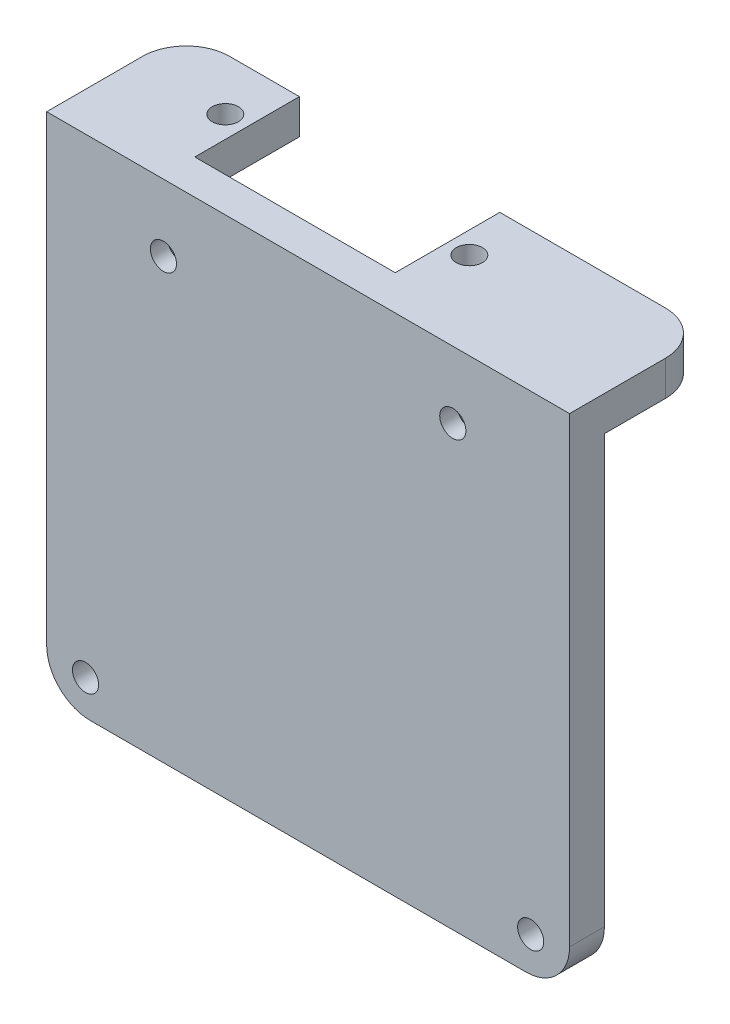
ISO-10303-21;
HEADER;
FILE_DESCRIPTION(('STEP AP214'),'2;1');
FILE_NAME('part.step','',(''),(''),'','','');
FILE_SCHEMA(('AUTOMOTIVE_DESIGN { 1 0 10303 214 1 1 1 1 }'));
ENDSEC;
DATA;
#1=APPLICATION_CONTEXT('core data for automotive mechanical design processes');
#2=APPLICATION_PROTOCOL_DEFINITION('international standard','automotive_design',2000,#1);
#3=PRODUCT_CONTEXT('',#1,'mechanical');
#4=PRODUCT('Part','Part','',(#3));
#5=PRODUCT_RELATED_PRODUCT_CATEGORY('part','',(#4));
#6=PRODUCT_DEFINITION_FORMATION('','',#4);
#7=PRODUCT_DEFINITION_CONTEXT('part definition',#1,'design');
#8=PRODUCT_DEFINITION('design','',#6,#7);
#9=PRODUCT_DEFINITION_SHAPE('','',#8);
#10=(LENGTH_UNIT() NAMED_UNIT(*) SI_UNIT(.MILLI.,.METRE.));
#11=(NAMED_UNIT(*) PLANE_ANGLE_UNIT() SI_UNIT($,.RADIAN.));
#12=(NAMED_UNIT(*) SI_UNIT($,.STERADIAN.) SOLID_ANGLE_UNIT());
#13=UNCERTAINTY_MEASURE_WITH_UNIT(LENGTH_MEASURE(1.E-05),#10,'distance_accuracy_value','');
#14=(GEOMETRIC_REPRESENTATION_CONTEXT(3) GLOBAL_UNCERTAINTY_ASSIGNED_CONTEXT((#13)) GLOBAL_UNIT_ASSIGNED_CONTEXT((#10,
#11,#12)) REPRESENTATION_CONTEXT('',''));
#15=CARTESIAN_POINT('',(0.,0.,0.));
#16=DIRECTION('',(0.,0.,1.));
#17=DIRECTION('',(1.,0.,0.));
#18=AXIS2_PLACEMENT_3D('',#15,#16,#17);
#19=CARTESIAN_POINT('',(55.,-53.,0.));
#20=DIRECTION('',(0.,0.,1.));
#21=DIRECTION('',(1.,0.,0.));
#22=AXIS2_PLACEMENT_3D('',#19,#20,#21);
#23=PLANE('',#22);
#24=CARTESIAN_POINT('',(55.540235122517,-53.9862116102653,0.));
#25=DIRECTION('',(0.,0.,1.));
#26=DIRECTION('',(-1.,0.,0.));
#27=AXIS2_PLACEMENT_3D('',#24,#25,#26);
#28=CIRCLE('',#27,1.5);
#29=CARTESIAN_POINT('',(54.040235122517,-53.9862116102653,0.));
#30=VERTEX_POINT('',#29);
#31=EDGE_CURVE('E297',#30,#30,#28,.T.);
#32=ORIENTED_EDGE('',*,*,#31,.T.);
#33=EDGE_LOOP('',(#32));
#34=FACE_BOUND('',#33,.T.);
#35=CARTESIAN_POINT('',(4.45976487748301,-53.9862116102653,0.));
#36=DIRECTION('',(0.,0.,1.));
#37=DIRECTION('',(1.,0.,0.));
#38=AXIS2_PLACEMENT_3D('',#35,#36,#37);
#39=CIRCLE('',#38,1.5);
#40=CARTESIAN_POINT('',(5.95976487748301,-53.9862116102653,0.));
#41=VERTEX_POINT('',#40);
#42=EDGE_CURVE('E291',#41,#41,#39,.T.);
#43=ORIENTED_EDGE('',*,*,#42,.T.);
#44=EDGE_LOOP('',(#43));
#45=FACE_BOUND('',#44,.T.);
#46=CARTESIAN_POINT('',(13.3970401574915,-7.66880337009083,0.));
#47=DIRECTION('',(0.,0.,1.));
#48=DIRECTION('',(1.,0.,0.));
#49=AXIS2_PLACEMENT_3D('',#46,#47,#48);
#50=CIRCLE('',#49,3.5);
#51=CARTESIAN_POINT('',(16.8970401574915,-7.66880337009083,0.));
#52=VERTEX_POINT('',#51);
#53=EDGE_CURVE('E349',#52,#52,#50,.T.);
#54=ORIENTED_EDGE('',*,*,#53,.T.);
#55=EDGE_LOOP('',(#54));
#56=FACE_BOUND('',#55,.T.);
#57=CARTESIAN_POINT('',(46.6029598425085,-7.66880337009083,0.));
#58=DIRECTION('',(0.,0.,1.));
#59=DIRECTION('',(1.,0.,0.));
#60=AXIS2_PLACEMENT_3D('',#57,#58,#59);
#61=CIRCLE('',#60,3.5);
#62=CARTESIAN_POINT('',(50.1029598425085,-7.66880337009083,0.));
#63=VERTEX_POINT('',#62);
#64=EDGE_CURVE('E352',#63,#63,#61,.T.);
#65=ORIENTED_EDGE('',*,*,#64,.T.);
#66=EDGE_LOOP('',(#65));
#67=FACE_BOUND('',#66,.T.);
#68=DIRECTION('',(0.,-1.,0.));
#69=VECTOR('',#68,1.);
#70=CARTESIAN_POINT('',(39.4977449043397,-53.,0.));
#71=LINE('',#70,#69);
#72=CARTESIAN_POINT('',(39.4977449043397,-53.,0.));
#73=VERTEX_POINT('',#72);
#74=CARTESIAN_POINT('',(39.4977449043397,-58.,0.));
#75=VERTEX_POINT('',#74);
#76=EDGE_CURVE('E181',#73,#75,#71,.T.);
#77=ORIENTED_EDGE('',*,*,#76,.F.);
#78=DIRECTION('',(1.,0.,0.));
#79=VECTOR('',#78,1.);
#80=CARTESIAN_POINT('',(19.4977449043397,-53.,0.));
#81=LINE('',#80,#79);
#82=CARTESIAN_POINT('',(19.4977449043397,-53.,0.));
#83=VERTEX_POINT('',#82);
#84=EDGE_CURVE('E190',#83,#73,#81,.T.);
#85=ORIENTED_EDGE('',*,*,#84,.F.);
#86=DIRECTION('',(0.,1.,0.));
#87=VECTOR('',#86,1.);
#88=CARTESIAN_POINT('',(19.4977449043397,-58.,0.));
#89=LINE('',#88,#87);
#90=CARTESIAN_POINT('',(19.4977449043397,-58.,0.));
#91=VERTEX_POINT('',#90);
#92=EDGE_CURVE('E200',#91,#83,#89,.T.);
#93=ORIENTED_EDGE('',*,*,#92,.F.);
#94=DIRECTION('',(1.,0.,0.));
#95=VECTOR('',#94,1.);
#96=CARTESIAN_POINT('',(5.00000000000001,-58.,0.));
#97=LINE('',#96,#95);
#98=CARTESIAN_POINT('',(5.00000000000001,-58.,0.));
#99=VERTEX_POINT('',#98);
#100=EDGE_CURVE('E309',#99,#91,#97,.T.);
#101=ORIENTED_EDGE('',*,*,#100,.F.);
#102=CARTESIAN_POINT('',(5.00000000000001,-53.,0.));
#103=DIRECTION('',(0.,0.,1.));
#104=DIRECTION('',(-1.,0.,0.));
#105=AXIS2_PLACEMENT_3D('',#102,#103,#104);
#106=CIRCLE('',#105,5.);
#107=CARTESIAN_POINT('',(0.,-53.,0.));
#108=VERTEX_POINT('',#107);
#109=EDGE_CURVE('E330',#108,#99,#106,.T.);
#110=ORIENTED_EDGE('',*,*,#109,.F.);
#111=DIRECTION('',(0.,-1.,0.));
#112=VECTOR('',#111,1.);
#113=CARTESIAN_POINT('',(0.,0.,0.));
#114=LINE('',#113,#112);
#115=CARTESIAN_POINT('',(0.,-4.,0.));
#116=VERTEX_POINT('',#115);
#117=EDGE_CURVE('E328',#116,#108,#114,.T.);
#118=ORIENTED_EDGE('',*,*,#117,.F.);
#119=DIRECTION('',(-1.,0.,0.));
#120=VECTOR('',#119,1.);
#121=CARTESIAN_POINT('',(8.00000000000001,-4.,0.));
#122=LINE('',#121,#120);
#123=CARTESIAN_POINT('',(13.,-4.,0.));
#124=VERTEX_POINT('',#123);
#125=EDGE_CURVE('E258',#124,#116,#122,.T.);
#126=ORIENTED_EDGE('',*,*,#125,.F.);
#127=DIRECTION('',(0.,-1.,0.));
#128=VECTOR('',#127,1.);
#129=CARTESIAN_POINT('',(13.,0.,0.));
#130=LINE('',#129,#128);
#131=CARTESIAN_POINT('',(13.,0.,0.));
#132=VERTEX_POINT('',#131);
#133=EDGE_CURVE('E260',#132,#124,#130,.T.);
#134=ORIENTED_EDGE('',*,*,#133,.F.);
#135=DIRECTION('',(-1.,0.,0.));
#136=VECTOR('',#135,1.);
#137=CARTESIAN_POINT('',(0.,0.,0.));
#138=LINE('',#137,#136);
#139=CARTESIAN_POINT('',(36.,0.,0.));
#140=VERTEX_POINT('',#139);
#141=EDGE_CURVE('E325',#140,#132,#138,.T.);
#142=ORIENTED_EDGE('',*,*,#141,.F.);
#143=DIRECTION('',(0.,1.,0.));
#144=VECTOR('',#143,1.);
#145=CARTESIAN_POINT('',(36.,0.,0.));
#146=LINE('',#145,#144);
#147=CARTESIAN_POINT('',(36.,-4.,0.));
#148=VERTEX_POINT('',#147);
#149=EDGE_CURVE('E272',#148,#140,#146,.T.);
#150=ORIENTED_EDGE('',*,*,#149,.F.);
#151=DIRECTION('',(-1.,0.,0.));
#152=VECTOR('',#151,1.);
#153=CARTESIAN_POINT('',(41.,-4.,0.));
#154=LINE('',#153,#152);
#155=CARTESIAN_POINT('',(60.,-3.99999999999998,0.));
#156=VERTEX_POINT('',#155);
#157=EDGE_CURVE('E263',#156,#148,#154,.T.);
#158=ORIENTED_EDGE('',*,*,#157,.F.);
#159=DIRECTION('',(0.,1.,0.));
#160=VECTOR('',#159,1.);
#161=CARTESIAN_POINT('',(60.,0.,0.));
#162=LINE('',#161,#160);
#163=CARTESIAN_POINT('',(60.,-53.,0.));
#164=VERTEX_POINT('',#163);
#165=EDGE_CURVE('E322',#164,#156,#162,.T.);
#166=ORIENTED_EDGE('',*,*,#165,.F.);
#167=CARTESIAN_POINT('',(55.,-53.,0.));
#168=DIRECTION('',(0.,0.,1.));
#169=DIRECTION('',(1.,0.,0.));
#170=AXIS2_PLACEMENT_3D('',#167,#168,#169);
#171=CIRCLE('',#170,5.);
#172=CARTESIAN_POINT('',(55.,-58.,0.));
#173=VERTEX_POINT('',#172);
#174=EDGE_CURVE('E304',#173,#164,#171,.T.);
#175=ORIENTED_EDGE('',*,*,#174,.F.);
#176=EDGE_CURVE('E199',#75,#173,#97,.T.);
#177=ORIENTED_EDGE('',*,*,#176,.F.);
#178=EDGE_LOOP('',(#77,#85,#93,#101,#110,#118,#126,#134,#142,#150,#158,#166,#175,#177));
#179=FACE_BOUND('',#178,.T.);
#180=ADVANCED_FACE('F39',(#34,#45,#56,#67,#179),#23,.F.);
#181=CARTESIAN_POINT('',(55.,-53.,4.));
#182=DIRECTION('',(0.,0.,-1.));
#183=DIRECTION('',(-1.,0.,0.));
#184=AXIS2_PLACEMENT_3D('',#181,#182,#183);
#185=CYLINDRICAL_SURFACE('',#184,5.);
#186=ORIENTED_EDGE('',*,*,#174,.T.);
#187=DIRECTION('',(0.,0.,-1.));
#188=VECTOR('',#187,1.);
#189=CARTESIAN_POINT('',(60.,-53.,4.));
#190=LINE('',#189,#188);
#191=CARTESIAN_POINT('',(60.,-53.,4.));
#192=VERTEX_POINT('',#191);
#193=EDGE_CURVE('E346',#192,#164,#190,.T.);
#194=ORIENTED_EDGE('',*,*,#193,.F.);
#195=CARTESIAN_POINT('',(55.,-53.,4.));
#196=DIRECTION('',(0.,0.,1.));
#197=DIRECTION('',(1.,0.,0.));
#198=AXIS2_PLACEMENT_3D('',#195,#196,#197);
#199=CIRCLE('',#198,5.);
#200=CARTESIAN_POINT('',(55.,-58.,4.));
#201=VERTEX_POINT('',#200);
#202=EDGE_CURVE('E305',#201,#192,#199,.T.);
#203=ORIENTED_EDGE('',*,*,#202,.F.);
#204=DIRECTION('',(0.,0.,-1.));
#205=VECTOR('',#204,1.);
#206=CARTESIAN_POINT('',(55.,-58.,4.));
#207=LINE('',#206,#205);
#208=EDGE_CURVE('E319',#201,#173,#207,.T.);
#209=ORIENTED_EDGE('',*,*,#208,.T.);
#210=EDGE_LOOP('',(#186,#194,#203,#209));
#211=FACE_BOUND('',#210,.T.);
#212=ADVANCED_FACE('F430',(#211),#185,.T.);
#213=CARTESIAN_POINT('',(60.,0.,4.));
#214=DIRECTION('',(-1.,0.,0.));
#215=DIRECTION('',(0.,-1.,0.));
#216=AXIS2_PLACEMENT_3D('',#213,#214,#215);
#217=PLANE('',#216);
#218=ORIENTED_EDGE('',*,*,#165,.T.);
#219=DIRECTION('',(0.,0.,-1.));
#220=VECTOR('',#219,1.);
#221=CARTESIAN_POINT('',(60.,-3.99999999999998,0.));
#222=LINE('',#221,#220);
#223=CARTESIAN_POINT('',(60.,-3.99999999999998,-7.));
#224=VERTEX_POINT('',#223);
#225=EDGE_CURVE('E241',#156,#224,#222,.T.);
#226=ORIENTED_EDGE('',*,*,#225,.T.);
#227=DIRECTION('',(0.,1.,0.));
#228=VECTOR('',#227,1.);
#229=CARTESIAN_POINT('',(60.,-3.99999999999998,-7.));
#230=LINE('',#229,#228);
#231=CARTESIAN_POINT('',(60.,0.,-7.));
#232=VERTEX_POINT('',#231);
#233=EDGE_CURVE('E247',#224,#232,#230,.T.);
#234=ORIENTED_EDGE('',*,*,#233,.T.);
#235=DIRECTION('',(0.,0.,-1.));
#236=VECTOR('',#235,1.);
#237=CARTESIAN_POINT('',(60.,0.,4.));
#238=LINE('',#237,#236);
#239=CARTESIAN_POINT('',(60.,0.,4.));
#240=VERTEX_POINT('',#239);
#241=EDGE_CURVE('E344',#240,#232,#238,.T.);
#242=ORIENTED_EDGE('',*,*,#241,.F.);
#243=DIRECTION('',(0.,1.,0.));
#244=VECTOR('',#243,1.);
#245=CARTESIAN_POINT('',(60.,0.,4.));
#246=LINE('',#245,#244);
#247=EDGE_CURVE('E308',#192,#240,#246,.T.);
#248=ORIENTED_EDGE('',*,*,#247,.F.);
#249=ORIENTED_EDGE('',*,*,#193,.T.);
#250=EDGE_LOOP('',(#218,#226,#234,#242,#248,#249));
#251=FACE_BOUND('',#250,.T.);
#252=ADVANCED_FACE('F427',(#251),#217,.F.);
#253=CARTESIAN_POINT('',(0.,0.,4.));
#254=DIRECTION('',(0.,-1.,0.));
#255=DIRECTION('',(1.,0.,0.));
#256=AXIS2_PLACEMENT_3D('',#253,#254,#255);
#257=PLANE('',#256);
#258=CARTESIAN_POINT('',(10.5,0.,-6.));
#259=DIRECTION('',(0.,1.,0.));
#260=DIRECTION('',(-1.,0.,0.));
#261=AXIS2_PLACEMENT_3D('',#258,#259,#260);
#262=CIRCLE('',#261,1.5);
#263=CARTESIAN_POINT('',(9.00000000000001,0.,-6.));
#264=VERTEX_POINT('',#263);
#265=EDGE_CURVE('E215',#264,#264,#262,.T.);
#266=ORIENTED_EDGE('',*,*,#265,.F.);
#267=EDGE_LOOP('',(#266));
#268=FACE_BOUND('',#267,.T.);
#269=CARTESIAN_POINT('',(38.5,0.,-6.));
#270=DIRECTION('',(0.,1.,0.));
#271=DIRECTION('',(1.,0.,0.));
#272=AXIS2_PLACEMENT_3D('',#269,#270,#271);
#273=CIRCLE('',#272,1.5);
#274=CARTESIAN_POINT('',(40.,0.,-6.));
#275=VERTEX_POINT('',#274);
#276=EDGE_CURVE('E218',#275,#275,#273,.T.);
#277=ORIENTED_EDGE('',*,*,#276,.F.);
#278=EDGE_LOOP('',(#277));
#279=FACE_BOUND('',#278,.T.);
#280=CARTESIAN_POINT('',(5.,0.,-7.));
#281=DIRECTION('',(0.,1.,0.));
#282=DIRECTION('',(1.,0.,0.));
#283=AXIS2_PLACEMENT_3D('',#280,#281,#282);
#284=CIRCLE('',#283,5.);
#285=CARTESIAN_POINT('',(5.,0.,-12.));
#286=VERTEX_POINT('',#285);
#287=CARTESIAN_POINT('',(0.,0.,-7.));
#288=VERTEX_POINT('',#287);
#289=EDGE_CURVE('E229',#286,#288,#284,.T.);
#290=ORIENTED_EDGE('',*,*,#289,.T.);
#291=DIRECTION('',(0.,0.,-1.));
#292=VECTOR('',#291,1.);
#293=CARTESIAN_POINT('',(0.,0.,4.));
#294=LINE('',#293,#292);
#295=CARTESIAN_POINT('',(0.,0.,4.));
#296=VERTEX_POINT('',#295);
#297=EDGE_CURVE('E342',#296,#288,#294,.T.);
#298=ORIENTED_EDGE('',*,*,#297,.F.);
#299=DIRECTION('',(-1.,0.,0.));
#300=VECTOR('',#299,1.);
#301=CARTESIAN_POINT('',(0.,0.,4.));
#302=LINE('',#301,#300);
#303=EDGE_CURVE('E311',#240,#296,#302,.T.);
#304=ORIENTED_EDGE('',*,*,#303,.F.);
#305=ORIENTED_EDGE('',*,*,#241,.T.);
#306=CARTESIAN_POINT('',(55.,0.,-7.));
#307=DIRECTION('',(0.,1.,0.));
#308=DIRECTION('',(-1.,0.,0.));
#309=AXIS2_PLACEMENT_3D('',#306,#307,#308);
#310=CIRCLE('',#309,5.);
#311=CARTESIAN_POINT('',(55.,0.,-12.));
#312=VERTEX_POINT('',#311);
#313=EDGE_CURVE('E232',#232,#312,#310,.T.);
#314=ORIENTED_EDGE('',*,*,#313,.T.);
#315=DIRECTION('',(1.,0.,0.));
#316=VECTOR('',#315,1.);
#317=CARTESIAN_POINT('',(41.,0.,-12.));
#318=LINE('',#317,#316);
#319=CARTESIAN_POINT('',(36.,0.,-12.));
#320=VERTEX_POINT('',#319);
#321=EDGE_CURVE('E269',#320,#312,#318,.T.);
#322=ORIENTED_EDGE('',*,*,#321,.F.);
#323=DIRECTION('',(0.,0.,1.));
#324=VECTOR('',#323,1.);
#325=CARTESIAN_POINT('',(36.,0.,-12.));
#326=LINE('',#325,#324);
#327=EDGE_CURVE('E276',#320,#140,#326,.T.);
#328=ORIENTED_EDGE('',*,*,#327,.T.);
#329=ORIENTED_EDGE('',*,*,#141,.T.);
#330=DIRECTION('',(0.,0.,1.));
#331=VECTOR('',#330,1.);
#332=CARTESIAN_POINT('',(13.,0.,-12.));
#333=LINE('',#332,#331);
#334=CARTESIAN_POINT('',(13.,0.,-12.));
#335=VERTEX_POINT('',#334);
#336=EDGE_CURVE('E250',#335,#132,#333,.T.);
#337=ORIENTED_EDGE('',*,*,#336,.F.);
#338=DIRECTION('',(1.,0.,0.));
#339=VECTOR('',#338,1.);
#340=CARTESIAN_POINT('',(8.00000000000001,0.,-12.));
#341=LINE('',#340,#339);
#342=EDGE_CURVE('E261',#286,#335,#341,.T.);
#343=ORIENTED_EDGE('',*,*,#342,.F.);
#344=EDGE_LOOP('',(#290,#298,#304,#305,#314,#322,#328,#329,#337,#343));
#345=FACE_BOUND('',#344,.T.);
#346=ADVANCED_FACE('F415',(#268,#279,#345),#257,.F.);
#347=CARTESIAN_POINT('',(0.,0.,4.));
#348=DIRECTION('',(1.,0.,0.));
#349=DIRECTION('',(0.,1.,0.));
#350=AXIS2_PLACEMENT_3D('',#347,#348,#349);
#351=PLANE('',#350);
#352=ORIENTED_EDGE('',*,*,#297,.T.);
#353=DIRECTION('',(0.,1.,0.));
#354=VECTOR('',#353,1.);
#355=CARTESIAN_POINT('',(0.,-4.,-7.));
#356=LINE('',#355,#354);
#357=CARTESIAN_POINT('',(0.,-4.,-7.));
#358=VERTEX_POINT('',#357);
#359=EDGE_CURVE('E214',#358,#288,#356,.T.);
#360=ORIENTED_EDGE('',*,*,#359,.F.);
#361=DIRECTION('',(0.,0.,1.));
#362=VECTOR('',#361,1.);
#363=CARTESIAN_POINT('',(0.,-4.,0.));
#364=LINE('',#363,#362);
#365=EDGE_CURVE('E233',#358,#116,#364,.T.);
#366=ORIENTED_EDGE('',*,*,#365,.T.);
#367=ORIENTED_EDGE('',*,*,#117,.T.);
#368=DIRECTION('',(0.,0.,-1.));
#369=VECTOR('',#368,1.);
#370=CARTESIAN_POINT('',(0.,-53.,4.));
#371=LINE('',#370,#369);
#372=CARTESIAN_POINT('',(0.,-53.,4.));
#373=VERTEX_POINT('',#372);
#374=EDGE_CURVE('E339',#373,#108,#371,.T.);
#375=ORIENTED_EDGE('',*,*,#374,.F.);
#376=DIRECTION('',(0.,-1.,0.));
#377=VECTOR('',#376,1.);
#378=CARTESIAN_POINT('',(0.,0.,4.));
#379=LINE('',#378,#377);
#380=EDGE_CURVE('E313',#296,#373,#379,.T.);
#381=ORIENTED_EDGE('',*,*,#380,.F.);
#382=EDGE_LOOP('',(#352,#360,#366,#367,#375,#381));
#383=FACE_BOUND('',#382,.T.);
#384=ADVANCED_FACE('F397',(#383),#351,.F.);
#385=CARTESIAN_POINT('',(5.00000000000001,-53.,4.));
#386=DIRECTION('',(0.,0.,-1.));
#387=DIRECTION('',(-1.,0.,0.));
#388=AXIS2_PLACEMENT_3D('',#385,#386,#387);
#389=CYLINDRICAL_SURFACE('',#388,5.);
#390=ORIENTED_EDGE('',*,*,#109,.T.);
#391=DIRECTION('',(0.,0.,-1.));
#392=VECTOR('',#391,1.);
#393=CARTESIAN_POINT('',(5.00000000000001,-58.,4.));
#394=LINE('',#393,#392);
#395=CARTESIAN_POINT('',(5.00000000000001,-58.,4.));
#396=VERTEX_POINT('',#395);
#397=EDGE_CURVE('E336',#396,#99,#394,.T.);
#398=ORIENTED_EDGE('',*,*,#397,.F.);
#399=CARTESIAN_POINT('',(5.00000000000001,-53.,4.));
#400=DIRECTION('',(0.,0.,1.));
#401=DIRECTION('',(-1.,0.,0.));
#402=AXIS2_PLACEMENT_3D('',#399,#400,#401);
#403=CIRCLE('',#402,5.);
#404=EDGE_CURVE('E315',#373,#396,#403,.T.);
#405=ORIENTED_EDGE('',*,*,#404,.F.);
#406=ORIENTED_EDGE('',*,*,#374,.T.);
#407=EDGE_LOOP('',(#390,#398,#405,#406));
#408=FACE_BOUND('',#407,.T.);
#409=ADVANCED_FACE('F391',(#408),#389,.T.);
#410=CARTESIAN_POINT('',(5.00000000000001,-58.,4.));
#411=DIRECTION('',(0.,1.,0.));
#412=DIRECTION('',(-1.,0.,0.));
#413=AXIS2_PLACEMENT_3D('',#410,#411,#412);
#414=PLANE('',#413);
#415=CARTESIAN_POINT('',(29.4977449043397,-58.,-5.00000000000002));
#416=DIRECTION('',(0.,-1.,0.));
#417=DIRECTION('',(1.,0.,0.));
#418=AXIS2_PLACEMENT_3D('',#415,#416,#417);
#419=CIRCLE('',#418,1.5);
#420=CARTESIAN_POINT('',(30.9977449043397,-58.,-5.00000000000002));
#421=VERTEX_POINT('',#420);
#422=EDGE_CURVE('E435',#421,#421,#419,.T.);
#423=ORIENTED_EDGE('',*,*,#422,.F.);
#424=EDGE_LOOP('',(#423));
#425=FACE_BOUND('',#424,.T.);
#426=DIRECTION('',(0.,0.,1.));
#427=VECTOR('',#426,1.);
#428=CARTESIAN_POINT('',(19.4977449043397,-58.,-10.));
#429=LINE('',#428,#427);
#430=CARTESIAN_POINT('',(19.4977449043397,-58.,-5.));
#431=VERTEX_POINT('',#430);
#432=EDGE_CURVE('E207',#431,#91,#429,.T.);
#433=ORIENTED_EDGE('',*,*,#432,.F.);
#434=CARTESIAN_POINT('',(24.4977449043397,-58.,-5.));
#435=DIRECTION('',(0.,1.,0.));
#436=DIRECTION('',(-1.,0.,0.));
#437=AXIS2_PLACEMENT_3D('',#434,#435,#436);
#438=CIRCLE('',#437,5.);
#439=CARTESIAN_POINT('',(24.4977449043397,-58.,-10.));
#440=VERTEX_POINT('',#439);
#441=EDGE_CURVE('E48',#431,#440,#438,.F.);
#442=ORIENTED_EDGE('',*,*,#441,.T.);
#443=DIRECTION('',(-1.,0.,0.));
#444=VECTOR('',#443,1.);
#445=CARTESIAN_POINT('',(39.4977449043397,-58.,-10.));
#446=LINE('',#445,#444);
#447=CARTESIAN_POINT('',(34.4977449043397,-58.,-10.));
#448=VERTEX_POINT('',#447);
#449=EDGE_CURVE('E208',#448,#440,#446,.T.);
#450=ORIENTED_EDGE('',*,*,#449,.F.);
#451=CARTESIAN_POINT('',(34.4977449043397,-58.,-5.));
#452=DIRECTION('',(0.,1.,0.));
#453=DIRECTION('',(-1.,0.,0.));
#454=AXIS2_PLACEMENT_3D('',#451,#452,#453);
#455=CIRCLE('',#454,5.);
#456=CARTESIAN_POINT('',(39.4977449043397,-58.,-5.));
#457=VERTEX_POINT('',#456);
#458=EDGE_CURVE('E55',#448,#457,#455,.F.);
#459=ORIENTED_EDGE('',*,*,#458,.T.);
#460=DIRECTION('',(0.,0.,1.));
#461=VECTOR('',#460,1.);
#462=CARTESIAN_POINT('',(39.4977449043397,-58.,-10.));
#463=LINE('',#462,#461);
#464=EDGE_CURVE('E187',#457,#75,#463,.T.);
#465=ORIENTED_EDGE('',*,*,#464,.T.);
#466=ORIENTED_EDGE('',*,*,#176,.T.);
#467=ORIENTED_EDGE('',*,*,#208,.F.);
#468=DIRECTION('',(1.,0.,0.));
#469=VECTOR('',#468,1.);
#470=CARTESIAN_POINT('',(5.00000000000001,-58.,4.));
#471=LINE('',#470,#469);
#472=EDGE_CURVE('E317',#396,#201,#471,.T.);
#473=ORIENTED_EDGE('',*,*,#472,.F.);
#474=ORIENTED_EDGE('',*,*,#397,.T.);
#475=ORIENTED_EDGE('',*,*,#100,.T.);
#476=EDGE_LOOP('',(#433,#442,#450,#459,#465,#466,#467,#473,#474,#475));
#477=FACE_BOUND('',#476,.T.);
#478=ADVANCED_FACE('F375',(#425,#477),#414,.F.);
#479=CARTESIAN_POINT('',(55.,-53.,4.));
#480=DIRECTION('',(0.,0.,1.));
#481=DIRECTION('',(1.,0.,0.));
#482=AXIS2_PLACEMENT_3D('',#479,#480,#481);
#483=PLANE('',#482);
#484=CARTESIAN_POINT('',(46.6029598425085,-7.66880337009083,4.));
#485=DIRECTION('',(0.,0.,1.));
#486=DIRECTION('',(-1.,0.,0.));
#487=AXIS2_PLACEMENT_3D('',#484,#485,#486);
#488=CIRCLE('',#487,1.5);
#489=CARTESIAN_POINT('',(45.1029598425085,-7.66880337009083,4.));
#490=VERTEX_POINT('',#489);
#491=EDGE_CURVE('E286',#490,#490,#488,.T.);
#492=ORIENTED_EDGE('',*,*,#491,.F.);
#493=EDGE_LOOP('',(#492));
#494=FACE_BOUND('',#493,.T.);
#495=CARTESIAN_POINT('',(55.540235122517,-53.9862116102653,4.));
#496=DIRECTION('',(0.,0.,1.));
#497=DIRECTION('',(-1.,0.,0.));
#498=AXIS2_PLACEMENT_3D('',#495,#496,#497);
#499=CIRCLE('',#498,1.5);
#500=CARTESIAN_POINT('',(54.040235122517,-53.9862116102653,4.));
#501=VERTEX_POINT('',#500);
#502=EDGE_CURVE('E294',#501,#501,#499,.T.);
#503=ORIENTED_EDGE('',*,*,#502,.F.);
#504=EDGE_LOOP('',(#503));
#505=FACE_BOUND('',#504,.T.);
#506=CARTESIAN_POINT('',(4.45976487748301,-53.9862116102653,4.));
#507=DIRECTION('',(0.,0.,1.));
#508=DIRECTION('',(1.,0.,0.));
#509=AXIS2_PLACEMENT_3D('',#506,#507,#508);
#510=CIRCLE('',#509,1.5);
#511=CARTESIAN_POINT('',(5.95976487748301,-53.9862116102653,4.));
#512=VERTEX_POINT('',#511);
#513=EDGE_CURVE('E287',#512,#512,#510,.T.);
#514=ORIENTED_EDGE('',*,*,#513,.F.);
#515=EDGE_LOOP('',(#514));
#516=FACE_BOUND('',#515,.T.);
#517=CARTESIAN_POINT('',(13.3970401574915,-7.66880337009083,4.));
#518=DIRECTION('',(0.,0.,1.));
#519=DIRECTION('',(1.,0.,0.));
#520=AXIS2_PLACEMENT_3D('',#517,#518,#519);
#521=CIRCLE('',#520,1.5);
#522=CARTESIAN_POINT('',(14.8970401574915,-7.66880337009083,4.));
#523=VERTEX_POINT('',#522);
#524=EDGE_CURVE('E290',#523,#523,#521,.T.);
#525=ORIENTED_EDGE('',*,*,#524,.F.);
#526=EDGE_LOOP('',(#525));
#527=FACE_BOUND('',#526,.T.);
#528=ORIENTED_EDGE('',*,*,#202,.T.);
#529=ORIENTED_EDGE('',*,*,#247,.T.);
#530=ORIENTED_EDGE('',*,*,#303,.T.);
#531=ORIENTED_EDGE('',*,*,#380,.T.);
#532=ORIENTED_EDGE('',*,*,#404,.T.);
#533=ORIENTED_EDGE('',*,*,#472,.T.);
#534=EDGE_LOOP('',(#528,#529,#530,#531,#532,#533));
#535=FACE_BOUND('',#534,.T.);
#536=ADVANCED_FACE('F460',(#494,#505,#516,#527,#535),#483,.T.);
#537=CARTESIAN_POINT('',(13.3970401574915,-7.66880337009083,0.));
#538=DIRECTION('',(0.,0.,1.));
#539=DIRECTION('',(1.,0.,0.));
#540=AXIS2_PLACEMENT_3D('',#537,#538,#539);
#541=CYLINDRICAL_SURFACE('',#540,1.5);
#542=CARTESIAN_POINT('',(13.3970401574915,-7.66880337009083,2.));
#543=DIRECTION('',(0.,0.,1.));
#544=DIRECTION('',(1.,0.,0.));
#545=AXIS2_PLACEMENT_3D('',#542,#543,#544);
#546=CIRCLE('',#545,1.5);
#547=CARTESIAN_POINT('',(14.8970401574915,-7.66880337009083,2.));
#548=VERTEX_POINT('',#547);
#549=EDGE_CURVE('E358',#548,#548,#546,.F.);
#550=ORIENTED_EDGE('',*,*,#549,.T.);
#551=EDGE_LOOP('',(#550));
#552=FACE_BOUND('',#551,.T.);
#553=ORIENTED_EDGE('',*,*,#524,.T.);
#554=EDGE_LOOP('',(#553));
#555=FACE_BOUND('',#554,.T.);
#556=ADVANCED_FACE('F535',(#552,#555),#541,.F.);
#557=CARTESIAN_POINT('',(4.45976487748301,-53.9862116102653,0.));
#558=DIRECTION('',(0.,0.,1.));
#559=DIRECTION('',(1.,0.,0.));
#560=AXIS2_PLACEMENT_3D('',#557,#558,#559);
#561=CYLINDRICAL_SURFACE('',#560,1.5);
#562=ORIENTED_EDGE('',*,*,#42,.F.);
#563=EDGE_LOOP('',(#562));
#564=FACE_BOUND('',#563,.T.);
#565=ORIENTED_EDGE('',*,*,#513,.T.);
#566=EDGE_LOOP('',(#565));
#567=FACE_BOUND('',#566,.T.);
#568=ADVANCED_FACE('F531',(#564,#567),#561,.F.);
#569=CARTESIAN_POINT('',(55.540235122517,-53.9862116102653,0.));
#570=DIRECTION('',(0.,0.,1.));
#571=DIRECTION('',(1.,0.,0.));
#572=AXIS2_PLACEMENT_3D('',#569,#570,#571);
#573=CYLINDRICAL_SURFACE('',#572,1.5);
#574=ORIENTED_EDGE('',*,*,#31,.F.);
#575=EDGE_LOOP('',(#574));
#576=FACE_BOUND('',#575,.T.);
#577=ORIENTED_EDGE('',*,*,#502,.T.);
#578=EDGE_LOOP('',(#577));
#579=FACE_BOUND('',#578,.T.);
#580=ADVANCED_FACE('F534',(#576,#579),#573,.F.);
#581=CARTESIAN_POINT('',(46.6029598425085,-7.66880337009083,0.));
#582=DIRECTION('',(0.,0.,1.));
#583=DIRECTION('',(1.,0.,0.));
#584=AXIS2_PLACEMENT_3D('',#581,#582,#583);
#585=CYLINDRICAL_SURFACE('',#584,1.5);
#586=CARTESIAN_POINT('',(46.6029598425085,-7.66880337009083,1.99999999999999));
#587=DIRECTION('',(0.,0.,1.));
#588=DIRECTION('',(1.,0.,0.));
#589=AXIS2_PLACEMENT_3D('',#586,#587,#588);
#590=CIRCLE('',#589,1.5);
#591=CARTESIAN_POINT('',(48.1029598425085,-7.66880337009083,1.99999999999999));
#592=VERTEX_POINT('',#591);
#593=EDGE_CURVE('E355',#592,#592,#590,.F.);
#594=ORIENTED_EDGE('',*,*,#593,.T.);
#595=EDGE_LOOP('',(#594));
#596=FACE_BOUND('',#595,.T.);
#597=ORIENTED_EDGE('',*,*,#491,.T.);
#598=EDGE_LOOP('',(#597));
#599=FACE_BOUND('',#598,.T.);
#600=ADVANCED_FACE('F529',(#596,#599),#585,.F.);
#601=CARTESIAN_POINT('',(41.,-4.,-12.));
#602=DIRECTION('',(0.,1.,0.));
#603=DIRECTION('',(-1.,0.,0.));
#604=AXIS2_PLACEMENT_3D('',#601,#602,#603);
#605=PLANE('',#604);
#606=CARTESIAN_POINT('',(38.5,-3.99999999999999,-6.));
#607=DIRECTION('',(0.,1.,0.));
#608=DIRECTION('',(1.,0.,0.));
#609=AXIS2_PLACEMENT_3D('',#606,#607,#608);
#610=CIRCLE('',#609,1.5);
#611=CARTESIAN_POINT('',(40.,-3.99999999999999,-6.));
#612=VERTEX_POINT('',#611);
#613=EDGE_CURVE('E186',#612,#612,#610,.T.);
#614=ORIENTED_EDGE('',*,*,#613,.T.);
#615=EDGE_LOOP('',(#614));
#616=FACE_BOUND('',#615,.T.);
#617=ORIENTED_EDGE('',*,*,#157,.T.);
#618=DIRECTION('',(0.,0.,1.));
#619=VECTOR('',#618,1.);
#620=CARTESIAN_POINT('',(36.,-4.,-12.));
#621=LINE('',#620,#619);
#622=CARTESIAN_POINT('',(36.,-4.,-12.));
#623=VERTEX_POINT('',#622);
#624=EDGE_CURVE('E283',#623,#148,#621,.T.);
#625=ORIENTED_EDGE('',*,*,#624,.F.);
#626=DIRECTION('',(-1.,0.,0.));
#627=VECTOR('',#626,1.);
#628=CARTESIAN_POINT('',(41.,-4.,-12.));
#629=LINE('',#628,#627);
#630=CARTESIAN_POINT('',(55.,-3.99999999999998,-12.));
#631=VERTEX_POINT('',#630);
#632=EDGE_CURVE('E271',#631,#623,#629,.T.);
#633=ORIENTED_EDGE('',*,*,#632,.F.);
#634=CARTESIAN_POINT('',(55.,-3.99999999999998,-7.));
#635=DIRECTION('',(0.,1.,0.));
#636=DIRECTION('',(-1.,0.,0.));
#637=AXIS2_PLACEMENT_3D('',#634,#635,#636);
#638=CIRCLE('',#637,5.);
#639=EDGE_CURVE('E238',#224,#631,#638,.T.);
#640=ORIENTED_EDGE('',*,*,#639,.F.);
#641=ORIENTED_EDGE('',*,*,#225,.F.);
#642=EDGE_LOOP('',(#617,#625,#633,#640,#641));
#643=FACE_BOUND('',#642,.T.);
#644=ADVANCED_FACE('F424',(#616,#643),#605,.F.);
#645=CARTESIAN_POINT('',(36.,0.,-12.));
#646=DIRECTION('',(1.,0.,0.));
#647=DIRECTION('',(0.,0.,-1.));
#648=AXIS2_PLACEMENT_3D('',#645,#646,#647);
#649=PLANE('',#648);
#650=ORIENTED_EDGE('',*,*,#149,.T.);
#651=ORIENTED_EDGE('',*,*,#327,.F.);
#652=DIRECTION('',(0.,1.,0.));
#653=VECTOR('',#652,1.);
#654=CARTESIAN_POINT('',(36.,0.,-12.));
#655=LINE('',#654,#653);
#656=EDGE_CURVE('E274',#623,#320,#655,.T.);
#657=ORIENTED_EDGE('',*,*,#656,.F.);
#658=ORIENTED_EDGE('',*,*,#624,.T.);
#659=EDGE_LOOP('',(#650,#651,#657,#658));
#660=FACE_BOUND('',#659,.T.);
#661=ADVANCED_FACE('F420',(#660),#649,.F.);
#662=CARTESIAN_POINT('',(0.,0.,-12.));
#663=DIRECTION('',(0.,0.,1.));
#664=DIRECTION('',(1.,0.,0.));
#665=AXIS2_PLACEMENT_3D('',#662,#663,#664);
#666=PLANE('',#665);
#667=ORIENTED_EDGE('',*,*,#321,.T.);
#668=DIRECTION('',(0.,1.,0.));
#669=VECTOR('',#668,1.);
#670=CARTESIAN_POINT('',(55.,-3.99999999999998,-12.));
#671=LINE('',#670,#669);
#672=EDGE_CURVE('E244',#631,#312,#671,.T.);
#673=ORIENTED_EDGE('',*,*,#672,.F.);
#674=ORIENTED_EDGE('',*,*,#632,.T.);
#675=ORIENTED_EDGE('',*,*,#656,.T.);
#676=EDGE_LOOP('',(#667,#673,#674,#675));
#677=FACE_BOUND('',#676,.T.);
#678=ADVANCED_FACE('F516',(#677),#666,.F.);
#679=CARTESIAN_POINT('',(13.,0.,-12.));
#680=DIRECTION('',(-1.,0.,0.));
#681=DIRECTION('',(0.,0.,1.));
#682=AXIS2_PLACEMENT_3D('',#679,#680,#681);
#683=PLANE('',#682);
#684=ORIENTED_EDGE('',*,*,#133,.T.);
#685=DIRECTION('',(0.,0.,1.));
#686=VECTOR('',#685,1.);
#687=CARTESIAN_POINT('',(13.,-4.,-12.));
#688=LINE('',#687,#686);
#689=CARTESIAN_POINT('',(13.,-4.,-12.));
#690=VERTEX_POINT('',#689);
#691=EDGE_CURVE('E254',#690,#124,#688,.T.);
#692=ORIENTED_EDGE('',*,*,#691,.F.);
#693=DIRECTION('',(0.,-1.,0.));
#694=VECTOR('',#693,1.);
#695=CARTESIAN_POINT('',(13.,0.,-12.));
#696=LINE('',#695,#694);
#697=EDGE_CURVE('E265',#335,#690,#696,.T.);
#698=ORIENTED_EDGE('',*,*,#697,.F.);
#699=ORIENTED_EDGE('',*,*,#336,.T.);
#700=EDGE_LOOP('',(#684,#692,#698,#699));
#701=FACE_BOUND('',#700,.T.);
#702=ADVANCED_FACE('F413',(#701),#683,.F.);
#703=CARTESIAN_POINT('',(8.00000000000001,-4.,-12.));
#704=DIRECTION('',(0.,1.,0.));
#705=DIRECTION('',(-1.,0.,0.));
#706=AXIS2_PLACEMENT_3D('',#703,#704,#705);
#707=PLANE('',#706);
#708=CARTESIAN_POINT('',(10.5,-4.,-6.));
#709=DIRECTION('',(0.,1.,0.));
#710=DIRECTION('',(-1.,0.,0.));
#711=AXIS2_PLACEMENT_3D('',#708,#709,#710);
#712=CIRCLE('',#711,1.5);
#713=CARTESIAN_POINT('',(9.00000000000001,-4.,-6.));
#714=VERTEX_POINT('',#713);
#715=EDGE_CURVE('E211',#714,#714,#712,.T.);
#716=ORIENTED_EDGE('',*,*,#715,.T.);
#717=EDGE_LOOP('',(#716));
#718=FACE_BOUND('',#717,.T.);
#719=ORIENTED_EDGE('',*,*,#125,.T.);
#720=ORIENTED_EDGE('',*,*,#365,.F.);
#721=CARTESIAN_POINT('',(5.,-4.,-7.));
#722=DIRECTION('',(0.,1.,0.));
#723=DIRECTION('',(1.,0.,0.));
#724=AXIS2_PLACEMENT_3D('',#721,#722,#723);
#725=CIRCLE('',#724,5.);
#726=CARTESIAN_POINT('',(5.,-4.,-12.));
#727=VERTEX_POINT('',#726);
#728=EDGE_CURVE('E226',#727,#358,#725,.T.);
#729=ORIENTED_EDGE('',*,*,#728,.F.);
#730=DIRECTION('',(-1.,0.,0.));
#731=VECTOR('',#730,1.);
#732=CARTESIAN_POINT('',(8.00000000000001,-4.,-12.));
#733=LINE('',#732,#731);
#734=EDGE_CURVE('E257',#690,#727,#733,.T.);
#735=ORIENTED_EDGE('',*,*,#734,.F.);
#736=ORIENTED_EDGE('',*,*,#691,.T.);
#737=EDGE_LOOP('',(#719,#720,#729,#735,#736));
#738=FACE_BOUND('',#737,.T.);
#739=ADVANCED_FACE('F402',(#718,#738),#707,.F.);
#740=CARTESIAN_POINT('',(0.,0.,-12.));
#741=DIRECTION('',(0.,0.,-1.));
#742=DIRECTION('',(-1.,0.,0.));
#743=AXIS2_PLACEMENT_3D('',#740,#741,#742);
#744=PLANE('',#743);
#745=ORIENTED_EDGE('',*,*,#342,.T.);
#746=ORIENTED_EDGE('',*,*,#697,.T.);
#747=ORIENTED_EDGE('',*,*,#734,.T.);
#748=DIRECTION('',(0.,1.,0.));
#749=VECTOR('',#748,1.);
#750=CARTESIAN_POINT('',(5.,-4.,-12.));
#751=LINE('',#750,#749);
#752=EDGE_CURVE('E223',#727,#286,#751,.T.);
#753=ORIENTED_EDGE('',*,*,#752,.T.);
#754=EDGE_LOOP('',(#745,#746,#747,#753));
#755=FACE_BOUND('',#754,.T.);
#756=ADVANCED_FACE('F409',(#755),#744,.T.);
#757=CARTESIAN_POINT('',(55.,-3.99999999999998,-7.));
#758=DIRECTION('',(0.,1.,0.));
#759=DIRECTION('',(-1.,0.,0.));
#760=AXIS2_PLACEMENT_3D('',#757,#758,#759);
#761=CYLINDRICAL_SURFACE('',#760,5.);
#762=ORIENTED_EDGE('',*,*,#313,.F.);
#763=ORIENTED_EDGE('',*,*,#233,.F.);
#764=ORIENTED_EDGE('',*,*,#639,.T.);
#765=ORIENTED_EDGE('',*,*,#672,.T.);
#766=EDGE_LOOP('',(#762,#763,#764,#765));
#767=FACE_BOUND('',#766,.T.);
#768=ADVANCED_FACE('F510',(#767),#761,.T.);
#769=CARTESIAN_POINT('',(5.,-4.,-7.));
#770=DIRECTION('',(0.,1.,0.));
#771=DIRECTION('',(-1.,0.,0.));
#772=AXIS2_PLACEMENT_3D('',#769,#770,#771);
#773=CYLINDRICAL_SURFACE('',#772,5.);
#774=ORIENTED_EDGE('',*,*,#289,.F.);
#775=ORIENTED_EDGE('',*,*,#752,.F.);
#776=ORIENTED_EDGE('',*,*,#728,.T.);
#777=ORIENTED_EDGE('',*,*,#359,.T.);
#778=EDGE_LOOP('',(#774,#775,#776,#777));
#779=FACE_BOUND('',#778,.T.);
#780=ADVANCED_FACE('F407',(#779),#773,.T.);
#781=CARTESIAN_POINT('',(10.5,-4.,-6.));
#782=DIRECTION('',(0.,1.,0.));
#783=DIRECTION('',(-1.,0.,0.));
#784=AXIS2_PLACEMENT_3D('',#781,#782,#783);
#785=CYLINDRICAL_SURFACE('',#784,1.5);
#786=ORIENTED_EDGE('',*,*,#715,.F.);
#787=EDGE_LOOP('',(#786));
#788=FACE_BOUND('',#787,.T.);
#789=ORIENTED_EDGE('',*,*,#265,.T.);
#790=EDGE_LOOP('',(#789));
#791=FACE_BOUND('',#790,.T.);
#792=ADVANCED_FACE('F501',(#788,#791),#785,.F.);
#793=CARTESIAN_POINT('',(38.5,-3.99999999999999,-6.));
#794=DIRECTION('',(0.,1.,0.));
#795=DIRECTION('',(-1.,0.,0.));
#796=AXIS2_PLACEMENT_3D('',#793,#794,#795);
#797=CYLINDRICAL_SURFACE('',#796,1.5);
#798=ORIENTED_EDGE('',*,*,#613,.F.);
#799=EDGE_LOOP('',(#798));
#800=FACE_BOUND('',#799,.T.);
#801=ORIENTED_EDGE('',*,*,#276,.T.);
#802=EDGE_LOOP('',(#801));
#803=FACE_BOUND('',#802,.T.);
#804=ADVANCED_FACE('F482',(#800,#803),#797,.F.);
#805=CARTESIAN_POINT('',(46.6029598425085,-7.66880337009083,0.));
#806=DIRECTION('',(0.,0.,-1.));
#807=DIRECTION('',(-1.,0.,0.));
#808=AXIS2_PLACEMENT_3D('',#805,#806,#807);
#809=CONICAL_SURFACE('',#808,3.5,0.785398163397448);
#810=ORIENTED_EDGE('',*,*,#593,.F.);
#811=EDGE_LOOP('',(#810));
#812=FACE_BOUND('',#811,.T.);
#813=ORIENTED_EDGE('',*,*,#64,.F.);
#814=EDGE_LOOP('',(#813));
#815=FACE_BOUND('',#814,.T.);
#816=ADVANCED_FACE('F475',(#812,#815),#809,.F.);
#817=CARTESIAN_POINT('',(13.3970401574915,-7.66880337009083,0.));
#818=DIRECTION('',(0.,0.,-1.));
#819=DIRECTION('',(-1.,0.,0.));
#820=AXIS2_PLACEMENT_3D('',#817,#818,#819);
#821=CONICAL_SURFACE('',#820,3.5,0.785398163397448);
#822=ORIENTED_EDGE('',*,*,#549,.F.);
#823=EDGE_LOOP('',(#822));
#824=FACE_BOUND('',#823,.T.);
#825=ORIENTED_EDGE('',*,*,#53,.F.);
#826=EDGE_LOOP('',(#825));
#827=FACE_BOUND('',#826,.T.);
#828=ADVANCED_FACE('F481',(#824,#827),#821,.F.);
#829=CARTESIAN_POINT('',(19.4977449043397,-53.,-10.));
#830=DIRECTION('',(0.,-1.,0.));
#831=DIRECTION('',(1.,0.,0.));
#832=AXIS2_PLACEMENT_3D('',#829,#830,#831);
#833=PLANE('',#832);
#834=CARTESIAN_POINT('',(29.4977449043397,-53.,-5.00000000000002));
#835=DIRECTION('',(0.,-1.,0.));
#836=DIRECTION('',(1.,0.,0.));
#837=AXIS2_PLACEMENT_3D('',#834,#835,#836);
#838=CIRCLE('',#837,1.5);
#839=CARTESIAN_POINT('',(30.9977449043397,-53.,-5.00000000000002));
#840=VERTEX_POINT('',#839);
#841=EDGE_CURVE('E43',#840,#840,#838,.T.);
#842=ORIENTED_EDGE('',*,*,#841,.T.);
#843=EDGE_LOOP('',(#842));
#844=FACE_BOUND('',#843,.T.);
#845=DIRECTION('',(1.,0.,0.));
#846=VECTOR('',#845,1.);
#847=CARTESIAN_POINT('',(19.4977449043397,-53.,-10.));
#848=LINE('',#847,#846);
#849=CARTESIAN_POINT('',(24.4977449043397,-53.,-10.));
#850=VERTEX_POINT('',#849);
#851=CARTESIAN_POINT('',(34.4977449043397,-53.,-10.));
#852=VERTEX_POINT('',#851);
#853=EDGE_CURVE('E202',#850,#852,#848,.T.);
#854=ORIENTED_EDGE('',*,*,#853,.F.);
#855=CARTESIAN_POINT('',(24.4977449043397,-53.,-5.));
#856=DIRECTION('',(0.,-1.,0.));
#857=DIRECTION('',(1.,0.,0.));
#858=AXIS2_PLACEMENT_3D('',#855,#856,#857);
#859=CIRCLE('',#858,5.);
#860=CARTESIAN_POINT('',(19.4977449043397,-53.,-5.));
#861=VERTEX_POINT('',#860);
#862=EDGE_CURVE('E369',#850,#861,#859,.F.);
#863=ORIENTED_EDGE('',*,*,#862,.T.);
#864=DIRECTION('',(0.,0.,1.));
#865=VECTOR('',#864,1.);
#866=CARTESIAN_POINT('',(19.4977449043397,-53.,-10.));
#867=LINE('',#866,#865);
#868=EDGE_CURVE('E193',#861,#83,#867,.T.);
#869=ORIENTED_EDGE('',*,*,#868,.T.);
#870=ORIENTED_EDGE('',*,*,#84,.T.);
#871=DIRECTION('',(0.,0.,1.));
#872=VECTOR('',#871,1.);
#873=CARTESIAN_POINT('',(39.4977449043397,-53.,-10.));
#874=LINE('',#873,#872);
#875=CARTESIAN_POINT('',(39.4977449043397,-53.,-5.));
#876=VERTEX_POINT('',#875);
#877=EDGE_CURVE('E177',#876,#73,#874,.T.);
#878=ORIENTED_EDGE('',*,*,#877,.F.);
#879=CARTESIAN_POINT('',(34.4977449043397,-53.,-5.));
#880=DIRECTION('',(0.,-1.,0.));
#881=DIRECTION('',(1.,0.,0.));
#882=AXIS2_PLACEMENT_3D('',#879,#880,#881);
#883=CIRCLE('',#882,5.);
#884=EDGE_CURVE('E367',#876,#852,#883,.F.);
#885=ORIENTED_EDGE('',*,*,#884,.T.);
#886=EDGE_LOOP('',(#854,#863,#869,#870,#878,#885));
#887=FACE_BOUND('',#886,.T.);
#888=ADVANCED_FACE('F192',(#844,#887),#833,.F.);
#889=CARTESIAN_POINT('',(39.4977449043397,-53.,-10.));
#890=DIRECTION('',(-1.,0.,0.));
#891=DIRECTION('',(0.,0.,1.));
#892=AXIS2_PLACEMENT_3D('',#889,#890,#891);
#893=PLANE('',#892);
#894=ORIENTED_EDGE('',*,*,#464,.F.);
#895=DIRECTION('',(0.,-1.,0.));
#896=VECTOR('',#895,1.);
#897=CARTESIAN_POINT('',(39.4977449043397,-53.,-5.));
#898=LINE('',#897,#896);
#899=EDGE_CURVE('E11',#457,#876,#898,.F.);
#900=ORIENTED_EDGE('',*,*,#899,.T.);
#901=ORIENTED_EDGE('',*,*,#877,.T.);
#902=ORIENTED_EDGE('',*,*,#76,.T.);
#903=EDGE_LOOP('',(#894,#900,#901,#902));
#904=FACE_BOUND('',#903,.T.);
#905=ADVANCED_FACE('F179',(#904),#893,.F.);
#906=CARTESIAN_POINT('',(19.4977449043397,-58.,-10.));
#907=DIRECTION('',(1.,0.,0.));
#908=DIRECTION('',(0.,0.,-1.));
#909=AXIS2_PLACEMENT_3D('',#906,#907,#908);
#910=PLANE('',#909);
#911=ORIENTED_EDGE('',*,*,#868,.F.);
#912=DIRECTION('',(0.,1.,0.));
#913=VECTOR('',#912,1.);
#914=CARTESIAN_POINT('',(19.4977449043397,-58.,-5.));
#915=LINE('',#914,#913);
#916=EDGE_CURVE('E63',#861,#431,#915,.F.);
#917=ORIENTED_EDGE('',*,*,#916,.T.);
#918=ORIENTED_EDGE('',*,*,#432,.T.);
#919=ORIENTED_EDGE('',*,*,#92,.T.);
#920=EDGE_LOOP('',(#911,#917,#918,#919));
#921=FACE_BOUND('',#920,.T.);
#922=ADVANCED_FACE('F383',(#921),#910,.F.);
#923=CARTESIAN_POINT('',(0.,0.,-10.));
#924=DIRECTION('',(0.,0.,-1.));
#925=DIRECTION('',(-1.,0.,0.));
#926=AXIS2_PLACEMENT_3D('',#923,#924,#925);
#927=PLANE('',#926);
#928=ORIENTED_EDGE('',*,*,#449,.T.);
#929=DIRECTION('',(0.,1.,0.));
#930=VECTOR('',#929,1.);
#931=CARTESIAN_POINT('',(24.4977449043397,-53.,-10.));
#932=LINE('',#931,#930);
#933=EDGE_CURVE('E364',#440,#850,#932,.T.);
#934=ORIENTED_EDGE('',*,*,#933,.T.);
#935=ORIENTED_EDGE('',*,*,#853,.T.);
#936=DIRECTION('',(0.,-1.,0.));
#937=VECTOR('',#936,1.);
#938=CARTESIAN_POINT('',(34.4977449043397,-58.,-10.));
#939=LINE('',#938,#937);
#940=EDGE_CURVE('E361',#852,#448,#939,.T.);
#941=ORIENTED_EDGE('',*,*,#940,.T.);
#942=EDGE_LOOP('',(#928,#934,#935,#941));
#943=FACE_BOUND('',#942,.T.);
#944=ADVANCED_FACE('F379',(#943),#927,.T.);
#945=CARTESIAN_POINT('',(24.4977449043397,0.,-5.));
#946=DIRECTION('',(0.,-1.,0.));
#947=DIRECTION('',(0.,0.,-1.));
#948=AXIS2_PLACEMENT_3D('',#945,#946,#947);
#949=CYLINDRICAL_SURFACE('',#948,5.);
#950=ORIENTED_EDGE('',*,*,#441,.F.);
#951=ORIENTED_EDGE('',*,*,#916,.F.);
#952=ORIENTED_EDGE('',*,*,#862,.F.);
#953=ORIENTED_EDGE('',*,*,#933,.F.);
#954=EDGE_LOOP('',(#950,#951,#952,#953));
#955=FACE_BOUND('',#954,.T.);
#956=ADVANCED_FACE('F382',(#955),#949,.T.);
#957=CARTESIAN_POINT('',(34.4977449043397,0.,-5.));
#958=DIRECTION('',(0.,1.,0.));
#959=DIRECTION('',(0.,0.,1.));
#960=AXIS2_PLACEMENT_3D('',#957,#958,#959);
#961=CYLINDRICAL_SURFACE('',#960,5.);
#962=ORIENTED_EDGE('',*,*,#884,.F.);
#963=ORIENTED_EDGE('',*,*,#899,.F.);
#964=ORIENTED_EDGE('',*,*,#458,.F.);
#965=ORIENTED_EDGE('',*,*,#940,.F.);
#966=EDGE_LOOP('',(#962,#963,#964,#965));
#967=FACE_BOUND('',#966,.T.);
#968=ADVANCED_FACE('F41',(#967),#961,.T.);
#969=CARTESIAN_POINT('',(29.4977449043397,-48.,-5.00000000000002));
#970=DIRECTION('',(0.,-1.,0.));
#971=DIRECTION('',(1.,0.,0.));
#972=AXIS2_PLACEMENT_3D('',#969,#970,#971);
#973=CYLINDRICAL_SURFACE('',#972,1.5);
#974=ORIENTED_EDGE('',*,*,#422,.T.);
#975=EDGE_LOOP('',(#974));
#976=FACE_BOUND('',#975,.T.);
#977=ORIENTED_EDGE('',*,*,#841,.F.);
#978=EDGE_LOOP('',(#977));
#979=FACE_BOUND('',#978,.T.);
#980=ADVANCED_FACE('F443',(#976,#979),#973,.F.);
#981=CLOSED_SHELL('',(#180,#212,#252,#346,#384,#409,#478,#536,#556,#568,#580,#600,#644,#661,
#678,#702,#739,#756,#768,#780,#792,#804,#816,#828,#888,#905,#922,#944,#956,#968,#980));
#982=MANIFOLD_SOLID_BREP('B2',#981);
#983=ADVANCED_BREP_SHAPE_REPRESENTATION('',(#18,#982),#14);
#984=SHAPE_DEFINITION_REPRESENTATION(#9,#983);
ENDSEC;
END-ISO-10303-21;
